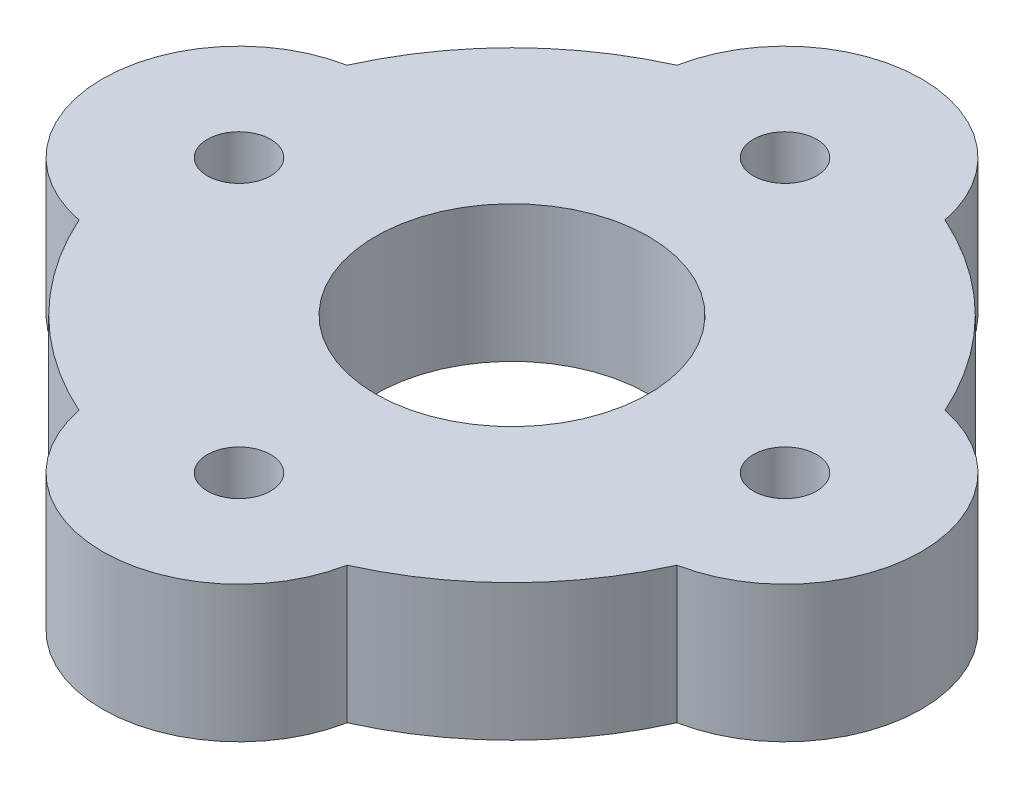
ISO-10303-21;
HEADER;
FILE_DESCRIPTION(('STEP AP214'),'2;1');
FILE_NAME('part.step','',(''),(''),'','','');
FILE_SCHEMA(('AUTOMOTIVE_DESIGN { 1 0 10303 214 1 1 1 1 }'));
ENDSEC;
DATA;
#1=APPLICATION_CONTEXT('core data for automotive mechanical design processes');
#2=APPLICATION_PROTOCOL_DEFINITION('international standard','automotive_design',2000,#1);
#3=PRODUCT_CONTEXT('',#1,'mechanical');
#4=PRODUCT('Part','Part','',(#3));
#5=PRODUCT_RELATED_PRODUCT_CATEGORY('part','',(#4));
#6=PRODUCT_DEFINITION_FORMATION('','',#4);
#7=PRODUCT_DEFINITION_CONTEXT('part definition',#1,'design');
#8=PRODUCT_DEFINITION('design','',#6,#7);
#9=PRODUCT_DEFINITION_SHAPE('','',#8);
#10=(LENGTH_UNIT() NAMED_UNIT(*) SI_UNIT(.MILLI.,.METRE.));
#11=(NAMED_UNIT(*) PLANE_ANGLE_UNIT() SI_UNIT($,.RADIAN.));
#12=(NAMED_UNIT(*) SI_UNIT($,.STERADIAN.) SOLID_ANGLE_UNIT());
#13=UNCERTAINTY_MEASURE_WITH_UNIT(LENGTH_MEASURE(1.E-05),#10,'distance_accuracy_value','');
#14=(GEOMETRIC_REPRESENTATION_CONTEXT(3) GLOBAL_UNCERTAINTY_ASSIGNED_CONTEXT((#13)) GLOBAL_UNIT_ASSIGNED_CONTEXT((#10,
#11,#12)) REPRESENTATION_CONTEXT('',''));
#15=CARTESIAN_POINT('',(0.,0.,0.));
#16=DIRECTION('',(0.,0.,1.));
#17=DIRECTION('',(1.,0.,0.));
#18=AXIS2_PLACEMENT_3D('',#15,#16,#17);
#19=CARTESIAN_POINT('',(0.,6.35,0.));
#20=DIRECTION('',(0.,-1.,0.));
#21=DIRECTION('',(0.,0.,-1.));
#22=AXIS2_PLACEMENT_3D('',#19,#20,#21);
#23=CYLINDRICAL_SURFACE('',#22,15.24);
#24=DIRECTION('',(0.,1.,0.));
#25=VECTOR('',#24,1.);
#26=CARTESIAN_POINT('',(-13.9064999999999,-13.4878843133384,-6.23432897351445));
#27=LINE('',#26,#25);
#28=CARTESIAN_POINT('',(-13.9064999999999,0.,-6.23432897351445));
#29=VERTEX_POINT('',#28);
#30=CARTESIAN_POINT('',(-13.9064999999999,6.35,-6.23432897351445));
#31=VERTEX_POINT('',#30);
#32=EDGE_CURVE('E52',#29,#31,#27,.T.);
#33=ORIENTED_EDGE('',*,*,#32,.T.);
#34=CARTESIAN_POINT('',(0.,6.35,0.));
#35=DIRECTION('',(0.,1.,0.));
#36=DIRECTION('',(0.,0.,1.));
#37=AXIS2_PLACEMENT_3D('',#34,#35,#36);
#38=CIRCLE('',#37,15.24);
#39=CARTESIAN_POINT('',(-6.23432897351431,6.35,-13.9065));
#40=VERTEX_POINT('',#39);
#41=EDGE_CURVE('E112',#31,#40,#38,.F.);
#42=ORIENTED_EDGE('',*,*,#41,.T.);
#43=DIRECTION('',(0.,1.,0.));
#44=VECTOR('',#43,1.);
#45=CARTESIAN_POINT('',(-6.23432897351431,-13.4878843133384,-13.9065));
#46=LINE('',#45,#44);
#47=CARTESIAN_POINT('',(-6.23432897351431,0.,-13.9065));
#48=VERTEX_POINT('',#47);
#49=EDGE_CURVE('E162',#48,#40,#46,.T.);
#50=ORIENTED_EDGE('',*,*,#49,.F.);
#51=CARTESIAN_POINT('',(0.,0.,0.));
#52=DIRECTION('',(0.,1.,0.));
#53=DIRECTION('',(0.,0.,1.));
#54=AXIS2_PLACEMENT_3D('',#51,#52,#53);
#55=CIRCLE('',#54,15.24);
#56=EDGE_CURVE('E114',#29,#48,#55,.F.);
#57=ORIENTED_EDGE('',*,*,#56,.F.);
#58=EDGE_LOOP('',(#33,#42,#50,#57));
#59=FACE_BOUND('',#58,.T.);
#60=ADVANCED_FACE('F35',(#59),#23,.T.);
#61=DIRECTION('',(0.,1.,0.));
#62=VECTOR('',#61,1.);
#63=CARTESIAN_POINT('',(-13.9065000000001,-13.4878843133384,6.23432897351416));
#64=LINE('',#63,#62);
#65=CARTESIAN_POINT('',(-13.9065000000001,0.,6.23432897351416));
#66=VERTEX_POINT('',#65);
#67=CARTESIAN_POINT('',(-13.9065000000001,6.35,6.23432897351416));
#68=VERTEX_POINT('',#67);
#69=EDGE_CURVE('E103',#66,#68,#64,.T.);
#70=ORIENTED_EDGE('',*,*,#69,.F.);
#71=CARTESIAN_POINT('',(-6.23432897351431,0.,13.9065));
#72=VERTEX_POINT('',#71);
#73=EDGE_CURVE('E192',#72,#66,#55,.F.);
#74=ORIENTED_EDGE('',*,*,#73,.F.);
#75=DIRECTION('',(0.,1.,0.));
#76=VECTOR('',#75,1.);
#77=CARTESIAN_POINT('',(-6.23432897351431,-13.4878843133384,13.9065));
#78=LINE('',#77,#76);
#79=CARTESIAN_POINT('',(-6.23432897351431,6.35,13.9065));
#80=VERTEX_POINT('',#79);
#81=EDGE_CURVE('E60',#72,#80,#78,.T.);
#82=ORIENTED_EDGE('',*,*,#81,.T.);
#83=EDGE_CURVE('E121',#80,#68,#38,.F.);
#84=ORIENTED_EDGE('',*,*,#83,.T.);
#85=EDGE_LOOP('',(#70,#74,#82,#84));
#86=FACE_BOUND('',#85,.T.);
#87=ADVANCED_FACE('F219',(#86),#23,.T.);
#88=DIRECTION('',(0.,1.,0.));
#89=VECTOR('',#88,1.);
#90=CARTESIAN_POINT('',(6.23432897351431,-13.4878843133384,13.9065));
#91=LINE('',#90,#89);
#92=CARTESIAN_POINT('',(6.23432897351431,0.,13.9065));
#93=VERTEX_POINT('',#92);
#94=CARTESIAN_POINT('',(6.23432897351431,6.35,13.9065));
#95=VERTEX_POINT('',#94);
#96=EDGE_CURVE('E138',#93,#95,#91,.T.);
#97=ORIENTED_EDGE('',*,*,#96,.F.);
#98=CARTESIAN_POINT('',(13.9065,0.,6.23432897351436));
#99=VERTEX_POINT('',#98);
#100=EDGE_CURVE('E196',#99,#93,#55,.F.);
#101=ORIENTED_EDGE('',*,*,#100,.F.);
#102=DIRECTION('',(0.,1.,0.));
#103=VECTOR('',#102,1.);
#104=CARTESIAN_POINT('',(13.9065,-13.4878843133384,6.23432897351436));
#105=LINE('',#104,#103);
#106=CARTESIAN_POINT('',(13.9065,6.35,6.23432897351436));
#107=VERTEX_POINT('',#106);
#108=EDGE_CURVE('E140',#99,#107,#105,.T.);
#109=ORIENTED_EDGE('',*,*,#108,.T.);
#110=EDGE_CURVE('E123',#107,#95,#38,.F.);
#111=ORIENTED_EDGE('',*,*,#110,.T.);
#112=EDGE_LOOP('',(#97,#101,#109,#111));
#113=FACE_BOUND('',#112,.T.);
#114=ADVANCED_FACE('F136',(#113),#23,.T.);
#115=DIRECTION('',(0.,1.,0.));
#116=VECTOR('',#115,1.);
#117=CARTESIAN_POINT('',(13.9065,-13.4878843133384,-6.23432897351426));
#118=LINE('',#117,#116);
#119=CARTESIAN_POINT('',(13.9065,0.,-6.23432897351426));
#120=VERTEX_POINT('',#119);
#121=CARTESIAN_POINT('',(13.9065,6.35,-6.23432897351426));
#122=VERTEX_POINT('',#121);
#123=EDGE_CURVE('E154',#120,#122,#118,.T.);
#124=ORIENTED_EDGE('',*,*,#123,.F.);
#125=CARTESIAN_POINT('',(6.23432897351431,0.,-13.9065));
#126=VERTEX_POINT('',#125);
#127=EDGE_CURVE('E125',#126,#120,#55,.F.);
#128=ORIENTED_EDGE('',*,*,#127,.F.);
#129=DIRECTION('',(0.,1.,0.));
#130=VECTOR('',#129,1.);
#131=CARTESIAN_POINT('',(6.23432897351431,-13.4878843133384,-13.9065));
#132=LINE('',#131,#130);
#133=CARTESIAN_POINT('',(6.23432897351431,6.35,-13.9065));
#134=VERTEX_POINT('',#133);
#135=EDGE_CURVE('E161',#126,#134,#132,.T.);
#136=ORIENTED_EDGE('',*,*,#135,.T.);
#137=EDGE_CURVE('E44',#134,#122,#38,.F.);
#138=ORIENTED_EDGE('',*,*,#137,.T.);
#139=EDGE_LOOP('',(#124,#128,#136,#138));
#140=FACE_BOUND('',#139,.T.);
#141=ADVANCED_FACE('F37',(#140),#23,.T.);
#142=CARTESIAN_POINT('',(0.,6.35,0.));
#143=DIRECTION('',(0.,-1.,0.));
#144=DIRECTION('',(0.,0.,-1.));
#145=AXIS2_PLACEMENT_3D('',#142,#143,#144);
#146=CYLINDRICAL_SURFACE('',#145,6.35);
#147=CARTESIAN_POINT('',(0.,6.35,0.));
#148=DIRECTION('',(0.,1.,0.));
#149=DIRECTION('',(0.,0.,1.));
#150=AXIS2_PLACEMENT_3D('',#147,#148,#149);
#151=CIRCLE('',#150,6.35);
#152=CARTESIAN_POINT('',(0.,6.35,6.35));
#153=VERTEX_POINT('',#152);
#154=EDGE_CURVE('E11',#153,#153,#151,.T.);
#155=ORIENTED_EDGE('',*,*,#154,.T.);
#156=EDGE_LOOP('',(#155));
#157=FACE_BOUND('',#156,.T.);
#158=CARTESIAN_POINT('',(0.,0.,0.));
#159=DIRECTION('',(0.,1.,0.));
#160=DIRECTION('',(0.,0.,1.));
#161=AXIS2_PLACEMENT_3D('',#158,#159,#160);
#162=CIRCLE('',#161,6.35);
#163=CARTESIAN_POINT('',(0.,0.,6.35));
#164=VERTEX_POINT('',#163);
#165=EDGE_CURVE('E39',#164,#164,#162,.T.);
#166=ORIENTED_EDGE('',*,*,#165,.F.);
#167=EDGE_LOOP('',(#166));
#168=FACE_BOUND('',#167,.T.);
#169=ADVANCED_FACE('F225',(#157,#168),#146,.F.);
#170=CARTESIAN_POINT('',(0.,6.35,0.));
#171=DIRECTION('',(0.,1.,0.));
#172=DIRECTION('',(0.,0.,1.));
#173=AXIS2_PLACEMENT_3D('',#170,#171,#172);
#174=PLANE('',#173);
#175=CARTESIAN_POINT('',(0.,6.35,-12.7));
#176=DIRECTION('',(0.,1.,0.));
#177=DIRECTION('',(0.,0.,1.));
#178=AXIS2_PLACEMENT_3D('',#175,#176,#177);
#179=CIRCLE('',#178,1.47319999999999);
#180=CARTESIAN_POINT('',(0.,6.35,-11.2268));
#181=VERTEX_POINT('',#180);
#182=EDGE_CURVE('E168',#181,#181,#179,.T.);
#183=ORIENTED_EDGE('',*,*,#182,.F.);
#184=EDGE_LOOP('',(#183));
#185=FACE_BOUND('',#184,.T.);
#186=CARTESIAN_POINT('',(-12.7,6.35,0.));
#187=DIRECTION('',(0.,1.,0.));
#188=DIRECTION('',(0.,0.,1.));
#189=AXIS2_PLACEMENT_3D('',#186,#187,#188);
#190=CIRCLE('',#189,1.47319999999999);
#191=CARTESIAN_POINT('',(-12.7,6.35,1.47319999999999));
#192=VERTEX_POINT('',#191);
#193=EDGE_CURVE('E174',#192,#192,#190,.T.);
#194=ORIENTED_EDGE('',*,*,#193,.F.);
#195=EDGE_LOOP('',(#194));
#196=FACE_BOUND('',#195,.T.);
#197=CARTESIAN_POINT('',(12.7,6.35,0.));
#198=DIRECTION('',(0.,1.,0.));
#199=DIRECTION('',(0.,0.,1.));
#200=AXIS2_PLACEMENT_3D('',#197,#198,#199);
#201=CIRCLE('',#200,1.47319999999999);
#202=CARTESIAN_POINT('',(12.7,6.35,1.47319999999999));
#203=VERTEX_POINT('',#202);
#204=EDGE_CURVE('E180',#203,#203,#201,.T.);
#205=ORIENTED_EDGE('',*,*,#204,.F.);
#206=EDGE_LOOP('',(#205));
#207=FACE_BOUND('',#206,.T.);
#208=CARTESIAN_POINT('',(0.,6.35,12.7));
#209=DIRECTION('',(0.,1.,0.));
#210=DIRECTION('',(0.,0.,1.));
#211=AXIS2_PLACEMENT_3D('',#208,#209,#210);
#212=CIRCLE('',#211,1.47319999999999);
#213=CARTESIAN_POINT('',(0.,6.35,14.1732));
#214=VERTEX_POINT('',#213);
#215=EDGE_CURVE('E186',#214,#214,#212,.T.);
#216=ORIENTED_EDGE('',*,*,#215,.F.);
#217=EDGE_LOOP('',(#216));
#218=FACE_BOUND('',#217,.T.);
#219=ORIENTED_EDGE('',*,*,#137,.F.);
#220=CARTESIAN_POINT('',(0.,6.35,-12.7));
#221=DIRECTION('',(0.,1.,0.));
#222=DIRECTION('',(0.,0.,-1.));
#223=AXIS2_PLACEMENT_3D('',#220,#221,#222);
#224=CIRCLE('',#223,6.35);
#225=EDGE_CURVE('E120',#134,#40,#224,.T.);
#226=ORIENTED_EDGE('',*,*,#225,.T.);
#227=ORIENTED_EDGE('',*,*,#41,.F.);
#228=CARTESIAN_POINT('',(-12.7,6.35,-1.33025439009923E-13));
#229=DIRECTION('',(0.,1.,0.));
#230=DIRECTION('',(-1.,0.,0.));
#231=AXIS2_PLACEMENT_3D('',#228,#229,#230);
#232=CIRCLE('',#231,6.35);
#233=EDGE_CURVE('E100',#31,#68,#232,.T.);
#234=ORIENTED_EDGE('',*,*,#233,.T.);
#235=ORIENTED_EDGE('',*,*,#83,.F.);
#236=CARTESIAN_POINT('',(0.,6.35,12.7));
#237=DIRECTION('',(0.,1.,0.));
#238=DIRECTION('',(0.,0.,1.));
#239=AXIS2_PLACEMENT_3D('',#236,#237,#238);
#240=CIRCLE('',#239,6.35);
#241=EDGE_CURVE('E144',#80,#95,#240,.T.);
#242=ORIENTED_EDGE('',*,*,#241,.T.);
#243=ORIENTED_EDGE('',*,*,#110,.F.);
#244=CARTESIAN_POINT('',(12.7,6.35,0.));
#245=DIRECTION('',(0.,1.,0.));
#246=DIRECTION('',(1.,0.,0.));
#247=AXIS2_PLACEMENT_3D('',#244,#245,#246);
#248=CIRCLE('',#247,6.35);
#249=EDGE_CURVE('E143',#107,#122,#248,.T.);
#250=ORIENTED_EDGE('',*,*,#249,.T.);
#251=EDGE_LOOP('',(#219,#226,#227,#234,#235,#242,#243,#250));
#252=FACE_BOUND('',#251,.T.);
#253=ORIENTED_EDGE('',*,*,#154,.F.);
#254=EDGE_LOOP('',(#253));
#255=FACE_BOUND('',#254,.T.);
#256=ADVANCED_FACE('F118',(#185,#196,#207,#218,#252,#255),#174,.T.);
#257=CARTESIAN_POINT('',(0.,0.,0.));
#258=DIRECTION('',(0.,1.,0.));
#259=DIRECTION('',(0.,0.,1.));
#260=AXIS2_PLACEMENT_3D('',#257,#258,#259);
#261=PLANE('',#260);
#262=CARTESIAN_POINT('',(0.,0.,-12.7));
#263=DIRECTION('',(0.,1.,0.));
#264=DIRECTION('',(0.,0.,1.));
#265=AXIS2_PLACEMENT_3D('',#262,#263,#264);
#266=CIRCLE('',#265,1.47319999999999);
#267=CARTESIAN_POINT('',(0.,0.,-11.2268));
#268=VERTEX_POINT('',#267);
#269=EDGE_CURVE('E171',#268,#268,#266,.T.);
#270=ORIENTED_EDGE('',*,*,#269,.T.);
#271=EDGE_LOOP('',(#270));
#272=FACE_BOUND('',#271,.T.);
#273=CARTESIAN_POINT('',(-12.7,0.,0.));
#274=DIRECTION('',(0.,1.,0.));
#275=DIRECTION('',(0.,0.,1.));
#276=AXIS2_PLACEMENT_3D('',#273,#274,#275);
#277=CIRCLE('',#276,1.47319999999999);
#278=CARTESIAN_POINT('',(-12.7,0.,1.47319999999999));
#279=VERTEX_POINT('',#278);
#280=EDGE_CURVE('E177',#279,#279,#277,.T.);
#281=ORIENTED_EDGE('',*,*,#280,.T.);
#282=EDGE_LOOP('',(#281));
#283=FACE_BOUND('',#282,.T.);
#284=CARTESIAN_POINT('',(12.7,0.,0.));
#285=DIRECTION('',(0.,1.,0.));
#286=DIRECTION('',(0.,0.,1.));
#287=AXIS2_PLACEMENT_3D('',#284,#285,#286);
#288=CIRCLE('',#287,1.47319999999999);
#289=CARTESIAN_POINT('',(12.7,0.,1.4732));
#290=VERTEX_POINT('',#289);
#291=EDGE_CURVE('E183',#290,#290,#288,.T.);
#292=ORIENTED_EDGE('',*,*,#291,.T.);
#293=EDGE_LOOP('',(#292));
#294=FACE_BOUND('',#293,.T.);
#295=CARTESIAN_POINT('',(0.,0.,12.7));
#296=DIRECTION('',(0.,1.,0.));
#297=DIRECTION('',(0.,0.,1.));
#298=AXIS2_PLACEMENT_3D('',#295,#296,#297);
#299=CIRCLE('',#298,1.47319999999999);
#300=CARTESIAN_POINT('',(0.,0.,14.1732));
#301=VERTEX_POINT('',#300);
#302=EDGE_CURVE('E188',#301,#301,#299,.T.);
#303=ORIENTED_EDGE('',*,*,#302,.T.);
#304=EDGE_LOOP('',(#303));
#305=FACE_BOUND('',#304,.T.);
#306=ORIENTED_EDGE('',*,*,#127,.T.);
#307=CARTESIAN_POINT('',(12.7,0.,0.));
#308=DIRECTION('',(0.,1.,0.));
#309=DIRECTION('',(0.,0.,1.));
#310=AXIS2_PLACEMENT_3D('',#307,#308,#309);
#311=CIRCLE('',#310,6.35);
#312=EDGE_CURVE('E156',#120,#99,#311,.F.);
#313=ORIENTED_EDGE('',*,*,#312,.T.);
#314=ORIENTED_EDGE('',*,*,#100,.T.);
#315=CARTESIAN_POINT('',(0.,0.,12.7));
#316=DIRECTION('',(0.,1.,0.));
#317=DIRECTION('',(0.,0.,1.));
#318=AXIS2_PLACEMENT_3D('',#315,#316,#317);
#319=CIRCLE('',#318,6.35);
#320=EDGE_CURVE('E150',#93,#72,#319,.F.);
#321=ORIENTED_EDGE('',*,*,#320,.T.);
#322=ORIENTED_EDGE('',*,*,#73,.T.);
#323=CARTESIAN_POINT('',(-12.7,0.,-1.33025439009923E-13));
#324=DIRECTION('',(0.,1.,0.));
#325=DIRECTION('',(0.,0.,1.));
#326=AXIS2_PLACEMENT_3D('',#323,#324,#325);
#327=CIRCLE('',#326,6.35);
#328=EDGE_CURVE('E145',#66,#29,#327,.F.);
#329=ORIENTED_EDGE('',*,*,#328,.T.);
#330=ORIENTED_EDGE('',*,*,#56,.T.);
#331=CARTESIAN_POINT('',(0.,0.,-12.7));
#332=DIRECTION('',(0.,1.,0.));
#333=DIRECTION('',(0.,0.,1.));
#334=AXIS2_PLACEMENT_3D('',#331,#332,#333);
#335=CIRCLE('',#334,6.35);
#336=EDGE_CURVE('E164',#48,#126,#335,.F.);
#337=ORIENTED_EDGE('',*,*,#336,.T.);
#338=EDGE_LOOP('',(#306,#313,#314,#321,#322,#329,#330,#337));
#339=FACE_BOUND('',#338,.T.);
#340=ORIENTED_EDGE('',*,*,#165,.T.);
#341=EDGE_LOOP('',(#340));
#342=FACE_BOUND('',#341,.T.);
#343=ADVANCED_FACE('F199',(#272,#283,#294,#305,#339,#342),#261,.F.);
#344=CARTESIAN_POINT('',(0.,6.35,12.7));
#345=DIRECTION('',(0.,1.,0.));
#346=DIRECTION('',(0.,0.,1.));
#347=AXIS2_PLACEMENT_3D('',#344,#345,#346);
#348=CYLINDRICAL_SURFACE('',#347,1.47319999999999);
#349=ORIENTED_EDGE('',*,*,#302,.F.);
#350=EDGE_LOOP('',(#349));
#351=FACE_BOUND('',#350,.T.);
#352=ORIENTED_EDGE('',*,*,#215,.T.);
#353=EDGE_LOOP('',(#352));
#354=FACE_BOUND('',#353,.T.);
#355=ADVANCED_FACE('F273',(#351,#354),#348,.F.);
#356=CARTESIAN_POINT('',(12.7,6.35,0.));
#357=DIRECTION('',(0.,1.,0.));
#358=DIRECTION('',(0.,0.,1.));
#359=AXIS2_PLACEMENT_3D('',#356,#357,#358);
#360=CYLINDRICAL_SURFACE('',#359,1.47319999999999);
#361=ORIENTED_EDGE('',*,*,#291,.F.);
#362=EDGE_LOOP('',(#361));
#363=FACE_BOUND('',#362,.T.);
#364=ORIENTED_EDGE('',*,*,#204,.T.);
#365=EDGE_LOOP('',(#364));
#366=FACE_BOUND('',#365,.T.);
#367=ADVANCED_FACE('F263',(#363,#366),#360,.F.);
#368=CARTESIAN_POINT('',(-12.7,6.35,0.));
#369=DIRECTION('',(0.,1.,0.));
#370=DIRECTION('',(0.,0.,1.));
#371=AXIS2_PLACEMENT_3D('',#368,#369,#370);
#372=CYLINDRICAL_SURFACE('',#371,1.47319999999999);
#373=ORIENTED_EDGE('',*,*,#280,.F.);
#374=EDGE_LOOP('',(#373));
#375=FACE_BOUND('',#374,.T.);
#376=ORIENTED_EDGE('',*,*,#193,.T.);
#377=EDGE_LOOP('',(#376));
#378=FACE_BOUND('',#377,.T.);
#379=ADVANCED_FACE('F215',(#375,#378),#372,.F.);
#380=CARTESIAN_POINT('',(0.,6.35,-12.7));
#381=DIRECTION('',(0.,1.,0.));
#382=DIRECTION('',(0.,0.,1.));
#383=AXIS2_PLACEMENT_3D('',#380,#381,#382);
#384=CYLINDRICAL_SURFACE('',#383,1.47319999999999);
#385=ORIENTED_EDGE('',*,*,#269,.F.);
#386=EDGE_LOOP('',(#385));
#387=FACE_BOUND('',#386,.T.);
#388=ORIENTED_EDGE('',*,*,#182,.T.);
#389=EDGE_LOOP('',(#388));
#390=FACE_BOUND('',#389,.T.);
#391=ADVANCED_FACE('F207',(#387,#390),#384,.F.);
#392=CARTESIAN_POINT('',(0.,-13.4878843133384,-12.7));
#393=DIRECTION('',(0.,1.,0.));
#394=DIRECTION('',(0.,0.,1.));
#395=AXIS2_PLACEMENT_3D('',#392,#393,#394);
#396=CYLINDRICAL_SURFACE('',#395,6.35);
#397=ORIENTED_EDGE('',*,*,#336,.F.);
#398=ORIENTED_EDGE('',*,*,#49,.T.);
#399=ORIENTED_EDGE('',*,*,#225,.F.);
#400=ORIENTED_EDGE('',*,*,#135,.F.);
#401=EDGE_LOOP('',(#397,#398,#399,#400));
#402=FACE_BOUND('',#401,.T.);
#403=ADVANCED_FACE('F205',(#402),#396,.T.);
#404=CARTESIAN_POINT('',(12.7,-13.4878843133384,0.));
#405=DIRECTION('',(0.,1.,0.));
#406=DIRECTION('',(0.,0.,1.));
#407=AXIS2_PLACEMENT_3D('',#404,#405,#406);
#408=CYLINDRICAL_SURFACE('',#407,6.35);
#409=ORIENTED_EDGE('',*,*,#312,.F.);
#410=ORIENTED_EDGE('',*,*,#123,.T.);
#411=ORIENTED_EDGE('',*,*,#249,.F.);
#412=ORIENTED_EDGE('',*,*,#108,.F.);
#413=EDGE_LOOP('',(#409,#410,#411,#412));
#414=FACE_BOUND('',#413,.T.);
#415=ADVANCED_FACE('F203',(#414),#408,.T.);
#416=CARTESIAN_POINT('',(0.,-13.4878843133384,12.7));
#417=DIRECTION('',(0.,1.,0.));
#418=DIRECTION('',(0.,0.,1.));
#419=AXIS2_PLACEMENT_3D('',#416,#417,#418);
#420=CYLINDRICAL_SURFACE('',#419,6.35);
#421=ORIENTED_EDGE('',*,*,#320,.F.);
#422=ORIENTED_EDGE('',*,*,#96,.T.);
#423=ORIENTED_EDGE('',*,*,#241,.F.);
#424=ORIENTED_EDGE('',*,*,#81,.F.);
#425=EDGE_LOOP('',(#421,#422,#423,#424));
#426=FACE_BOUND('',#425,.T.);
#427=ADVANCED_FACE('F213',(#426),#420,.T.);
#428=CARTESIAN_POINT('',(-12.7,-13.4878843133384,-1.33025439009923E-13));
#429=DIRECTION('',(0.,1.,0.));
#430=DIRECTION('',(0.,0.,1.));
#431=AXIS2_PLACEMENT_3D('',#428,#429,#430);
#432=CYLINDRICAL_SURFACE('',#431,6.35);
#433=ORIENTED_EDGE('',*,*,#328,.F.);
#434=ORIENTED_EDGE('',*,*,#69,.T.);
#435=ORIENTED_EDGE('',*,*,#233,.F.);
#436=ORIENTED_EDGE('',*,*,#32,.F.);
#437=EDGE_LOOP('',(#433,#434,#435,#436));
#438=FACE_BOUND('',#437,.T.);
#439=ADVANCED_FACE('F101',(#438),#432,.T.);
#440=CLOSED_SHELL('',(#60,#87,#114,#141,#169,#256,#343,#355,#367,#379,#391,#403,#415,#427,#439));
#441=MANIFOLD_SOLID_BREP('B2',#440);
#442=ADVANCED_BREP_SHAPE_REPRESENTATION('',(#18,#441),#14);
#443=SHAPE_DEFINITION_REPRESENTATION(#9,#442);
ENDSEC;
END-ISO-10303-21;
